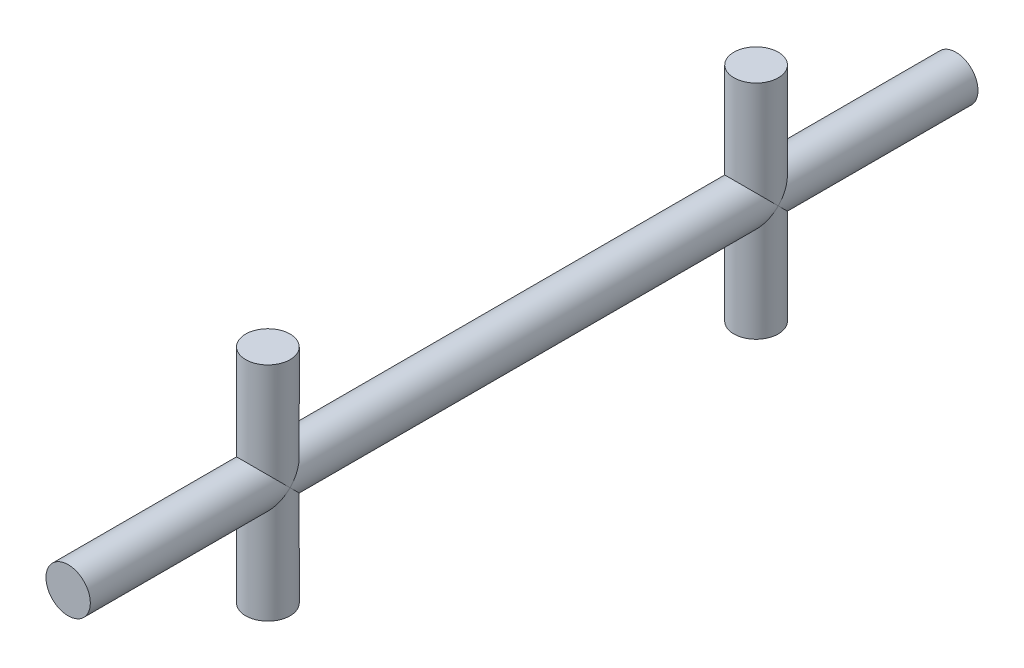
ISO-10303-21;
HEADER;
FILE_DESCRIPTION(('STEP AP214'),'2;1');
FILE_NAME('part.step','',(''),(''),'','','');
FILE_SCHEMA(('AUTOMOTIVE_DESIGN { 1 0 10303 214 1 1 1 1 }'));
ENDSEC;
DATA;
#1=APPLICATION_CONTEXT('core data for automotive mechanical design processes');
#2=APPLICATION_PROTOCOL_DEFINITION('international standard','automotive_design',2000,#1);
#3=PRODUCT_CONTEXT('',#1,'mechanical');
#4=PRODUCT('Part','Part','',(#3));
#5=PRODUCT_RELATED_PRODUCT_CATEGORY('part','',(#4));
#6=PRODUCT_DEFINITION_FORMATION('','',#4);
#7=PRODUCT_DEFINITION_CONTEXT('part definition',#1,'design');
#8=PRODUCT_DEFINITION('design','',#6,#7);
#9=PRODUCT_DEFINITION_SHAPE('','',#8);
#10=(LENGTH_UNIT() NAMED_UNIT(*) SI_UNIT(.MILLI.,.METRE.));
#11=(NAMED_UNIT(*) PLANE_ANGLE_UNIT() SI_UNIT($,.RADIAN.));
#12=(NAMED_UNIT(*) SI_UNIT($,.STERADIAN.) SOLID_ANGLE_UNIT());
#13=UNCERTAINTY_MEASURE_WITH_UNIT(LENGTH_MEASURE(1.E-05),#10,'distance_accuracy_value','');
#14=(GEOMETRIC_REPRESENTATION_CONTEXT(3) GLOBAL_UNCERTAINTY_ASSIGNED_CONTEXT((#13)) GLOBAL_UNIT_ASSIGNED_CONTEXT((#10,
#11,#12)) REPRESENTATION_CONTEXT('',''));
#15=CARTESIAN_POINT('',(0.,0.,0.));
#16=DIRECTION('',(0.,0.,1.));
#17=DIRECTION('',(1.,0.,0.));
#18=AXIS2_PLACEMENT_3D('',#15,#16,#17);
#19=CARTESIAN_POINT('',(0.,0.,-40.));
#20=DIRECTION('',(0.,0.,1.));
#21=DIRECTION('',(1.,0.,0.));
#22=AXIS2_PLACEMENT_3D('',#19,#20,#21);
#23=CYLINDRICAL_SURFACE('',#22,1.);
#24=CARTESIAN_POINT('',(0.,0.,-31.));
#25=DIRECTION('',(0.,0.707106781186547,0.707106781186547));
#26=DIRECTION('',(0.,-0.707106781186547,0.707106781186547));
#27=AXIS2_PLACEMENT_3D('',#24,#25,#26);
#28=ELLIPSE('',#27,1.4142135623731,1.);
#29=CARTESIAN_POINT('',(1.,0.,-31.));
#30=VERTEX_POINT('',#29);
#31=CARTESIAN_POINT('',(-1.,0.,-31.));
#32=VERTEX_POINT('',#31);
#33=EDGE_CURVE('E11',#30,#32,#28,.F.);
#34=ORIENTED_EDGE('',*,*,#33,.F.);
#35=CARTESIAN_POINT('',(0.,0.,-31.));
#36=DIRECTION('',(0.,-0.707106781186547,0.707106781186547));
#37=DIRECTION('',(0.,0.707106781186547,0.707106781186547));
#38=AXIS2_PLACEMENT_3D('',#35,#36,#37);
#39=ELLIPSE('',#38,1.4142135623731,1.);
#40=EDGE_CURVE('E46',#32,#30,#39,.F.);
#41=ORIENTED_EDGE('',*,*,#40,.F.);
#42=EDGE_LOOP('',(#34,#41));
#43=FACE_BOUND('',#42,.T.);
#44=CARTESIAN_POINT('',(0.,0.,-9.));
#45=DIRECTION('',(0.,0.707106781186547,0.707106781186547));
#46=DIRECTION('',(0.,-0.707106781186547,0.707106781186547));
#47=AXIS2_PLACEMENT_3D('',#44,#45,#46);
#48=ELLIPSE('',#47,1.4142135623731,1.);
#49=CARTESIAN_POINT('',(1.,0.,-9.));
#50=VERTEX_POINT('',#49);
#51=CARTESIAN_POINT('',(-1.,0.,-9.));
#52=VERTEX_POINT('',#51);
#53=EDGE_CURVE('E65',#50,#52,#48,.T.);
#54=ORIENTED_EDGE('',*,*,#53,.F.);
#55=CARTESIAN_POINT('',(0.,0.,-9.));
#56=DIRECTION('',(0.,-0.707106781186547,0.707106781186547));
#57=DIRECTION('',(0.,0.707106781186547,0.707106781186547));
#58=AXIS2_PLACEMENT_3D('',#55,#56,#57);
#59=ELLIPSE('',#58,1.4142135623731,1.);
#60=EDGE_CURVE('E62',#52,#50,#59,.T.);
#61=ORIENTED_EDGE('',*,*,#60,.F.);
#62=EDGE_LOOP('',(#54,#61));
#63=FACE_BOUND('',#62,.T.);
#64=ADVANCED_FACE('F32',(#43,#63),#23,.T.);
#65=CARTESIAN_POINT('',(0.,5.,-9.));
#66=DIRECTION('',(0.,1.,0.));
#67=DIRECTION('',(0.,0.,1.));
#68=AXIS2_PLACEMENT_3D('',#65,#66,#67);
#69=PLANE('',#68);
#70=CARTESIAN_POINT('',(0.,5.,-9.));
#71=DIRECTION('',(0.,1.,0.));
#72=DIRECTION('',(0.,0.,1.));
#73=AXIS2_PLACEMENT_3D('',#70,#71,#72);
#74=CIRCLE('',#73,1.);
#75=CARTESIAN_POINT('',(0.,5.,-8.));
#76=VERTEX_POINT('',#75);
#77=EDGE_CURVE('E118',#76,#76,#74,.T.);
#78=ORIENTED_EDGE('',*,*,#77,.T.);
#79=EDGE_LOOP('',(#78));
#80=FACE_BOUND('',#79,.T.);
#81=ADVANCED_FACE('F91',(#80),#69,.T.);
#82=CARTESIAN_POINT('',(0.,-5.,-9.));
#83=DIRECTION('',(0.,1.,0.));
#84=DIRECTION('',(0.,0.,1.));
#85=AXIS2_PLACEMENT_3D('',#82,#83,#84);
#86=CYLINDRICAL_SURFACE('',#85,1.);
#87=ORIENTED_EDGE('',*,*,#77,.F.);
#88=EDGE_LOOP('',(#87));
#89=FACE_BOUND('',#88,.T.);
#90=CARTESIAN_POINT('',(0.,0.,-9.));
#91=DIRECTION('',(0.,-0.707106781186547,0.707106781186547));
#92=DIRECTION('',(0.,0.707106781186547,0.707106781186547));
#93=AXIS2_PLACEMENT_3D('',#90,#91,#92);
#94=ELLIPSE('',#93,1.4142135623731,1.);
#95=EDGE_CURVE('E68',#52,#50,#94,.F.);
#96=ORIENTED_EDGE('',*,*,#95,.T.);
#97=ORIENTED_EDGE('',*,*,#53,.T.);
#98=EDGE_LOOP('',(#96,#97));
#99=FACE_BOUND('',#98,.T.);
#100=ADVANCED_FACE('F78',(#89,#99),#86,.T.);
#101=CARTESIAN_POINT('',(0.,0.,0.));
#102=DIRECTION('',(0.,0.,1.));
#103=DIRECTION('',(1.,0.,0.));
#104=AXIS2_PLACEMENT_3D('',#101,#102,#103);
#105=PLANE('',#104);
#106=CARTESIAN_POINT('',(0.,0.,0.));
#107=DIRECTION('',(0.,0.,1.));
#108=DIRECTION('',(1.,0.,0.));
#109=AXIS2_PLACEMENT_3D('',#106,#107,#108);
#110=CIRCLE('',#109,1.);
#111=CARTESIAN_POINT('',(1.,0.,0.));
#112=VERTEX_POINT('',#111);
#113=EDGE_CURVE('E110',#112,#112,#110,.T.);
#114=ORIENTED_EDGE('',*,*,#113,.T.);
#115=EDGE_LOOP('',(#114));
#116=FACE_BOUND('',#115,.T.);
#117=ADVANCED_FACE('F98',(#116),#105,.T.);
#118=CARTESIAN_POINT('',(0.,0.,-9.));
#119=DIRECTION('',(0.,0.707106781186547,0.707106781186547));
#120=DIRECTION('',(0.,-0.707106781186547,0.707106781186547));
#121=AXIS2_PLACEMENT_3D('',#118,#119,#120);
#122=ELLIPSE('',#121,1.4142135623731,1.);
#123=EDGE_CURVE('E74',#50,#52,#122,.F.);
#124=ORIENTED_EDGE('',*,*,#123,.F.);
#125=ORIENTED_EDGE('',*,*,#95,.F.);
#126=EDGE_LOOP('',(#124,#125));
#127=FACE_BOUND('',#126,.T.);
#128=ORIENTED_EDGE('',*,*,#113,.F.);
#129=EDGE_LOOP('',(#128));
#130=FACE_BOUND('',#129,.T.);
#131=ADVANCED_FACE('F72',(#127,#130),#23,.T.);
#132=ORIENTED_EDGE('',*,*,#60,.T.);
#133=ORIENTED_EDGE('',*,*,#123,.T.);
#134=EDGE_LOOP('',(#132,#133));
#135=FACE_BOUND('',#134,.T.);
#136=CARTESIAN_POINT('',(0.,-5.,-9.));
#137=DIRECTION('',(0.,1.,0.));
#138=DIRECTION('',(0.,0.,1.));
#139=AXIS2_PLACEMENT_3D('',#136,#137,#138);
#140=CIRCLE('',#139,1.);
#141=CARTESIAN_POINT('',(0.,-5.,-8.));
#142=VERTEX_POINT('',#141);
#143=EDGE_CURVE('E113',#142,#142,#140,.T.);
#144=ORIENTED_EDGE('',*,*,#143,.T.);
#145=EDGE_LOOP('',(#144));
#146=FACE_BOUND('',#145,.T.);
#147=ADVANCED_FACE('F80',(#135,#146),#86,.T.);
#148=CARTESIAN_POINT('',(0.,-5.,-9.));
#149=DIRECTION('',(0.,1.,0.));
#150=DIRECTION('',(0.,0.,1.));
#151=AXIS2_PLACEMENT_3D('',#148,#149,#150);
#152=PLANE('',#151);
#153=ORIENTED_EDGE('',*,*,#143,.F.);
#154=EDGE_LOOP('',(#153));
#155=FACE_BOUND('',#154,.T.);
#156=ADVANCED_FACE('F136',(#155),#152,.F.);
#157=CARTESIAN_POINT('',(0.,5.,-31.));
#158=DIRECTION('',(0.,1.,0.));
#159=DIRECTION('',(0.,0.,1.));
#160=AXIS2_PLACEMENT_3D('',#157,#158,#159);
#161=PLANE('',#160);
#162=CARTESIAN_POINT('',(0.,5.,-31.));
#163=DIRECTION('',(0.,1.,0.));
#164=DIRECTION('',(0.,0.,1.));
#165=AXIS2_PLACEMENT_3D('',#162,#163,#164);
#166=CIRCLE('',#165,1.);
#167=CARTESIAN_POINT('',(0.,5.,-30.));
#168=VERTEX_POINT('',#167);
#169=EDGE_CURVE('E124',#168,#168,#166,.T.);
#170=ORIENTED_EDGE('',*,*,#169,.T.);
#171=EDGE_LOOP('',(#170));
#172=FACE_BOUND('',#171,.T.);
#173=ADVANCED_FACE('F128',(#172),#161,.T.);
#174=CARTESIAN_POINT('',(0.,-5.,-31.));
#175=DIRECTION('',(0.,1.,0.));
#176=DIRECTION('',(0.,0.,1.));
#177=AXIS2_PLACEMENT_3D('',#174,#175,#176);
#178=CYLINDRICAL_SURFACE('',#177,1.);
#179=ORIENTED_EDGE('',*,*,#169,.F.);
#180=EDGE_LOOP('',(#179));
#181=FACE_BOUND('',#180,.T.);
#182=ORIENTED_EDGE('',*,*,#40,.T.);
#183=CARTESIAN_POINT('',(0.,0.,-31.));
#184=DIRECTION('',(0.,0.707106781186547,0.707106781186547));
#185=DIRECTION('',(0.,-0.707106781186547,0.707106781186547));
#186=AXIS2_PLACEMENT_3D('',#183,#184,#185);
#187=ELLIPSE('',#186,1.4142135623731,1.);
#188=EDGE_CURVE('E40',#30,#32,#187,.T.);
#189=ORIENTED_EDGE('',*,*,#188,.T.);
#190=EDGE_LOOP('',(#182,#189));
#191=FACE_BOUND('',#190,.T.);
#192=ADVANCED_FACE('F85',(#181,#191),#178,.T.);
#193=CARTESIAN_POINT('',(0.,0.,-31.));
#194=DIRECTION('',(0.,-0.707106781186547,0.707106781186547));
#195=DIRECTION('',(0.,0.707106781186547,0.707106781186547));
#196=AXIS2_PLACEMENT_3D('',#193,#194,#195);
#197=ELLIPSE('',#196,1.4142135623731,1.);
#198=EDGE_CURVE('E53',#32,#30,#197,.T.);
#199=ORIENTED_EDGE('',*,*,#198,.T.);
#200=ORIENTED_EDGE('',*,*,#33,.T.);
#201=EDGE_LOOP('',(#199,#200));
#202=FACE_BOUND('',#201,.T.);
#203=CARTESIAN_POINT('',(0.,-5.,-31.));
#204=DIRECTION('',(0.,1.,0.));
#205=DIRECTION('',(0.,0.,1.));
#206=AXIS2_PLACEMENT_3D('',#203,#204,#205);
#207=CIRCLE('',#206,1.);
#208=CARTESIAN_POINT('',(0.,-5.,-30.));
#209=VERTEX_POINT('',#208);
#210=EDGE_CURVE('E121',#209,#209,#207,.T.);
#211=ORIENTED_EDGE('',*,*,#210,.T.);
#212=EDGE_LOOP('',(#211));
#213=FACE_BOUND('',#212,.T.);
#214=ADVANCED_FACE('F87',(#202,#213),#178,.T.);
#215=CARTESIAN_POINT('',(0.,-5.,-31.));
#216=DIRECTION('',(0.,1.,0.));
#217=DIRECTION('',(0.,0.,1.));
#218=AXIS2_PLACEMENT_3D('',#215,#216,#217);
#219=PLANE('',#218);
#220=ORIENTED_EDGE('',*,*,#210,.F.);
#221=EDGE_LOOP('',(#220));
#222=FACE_BOUND('',#221,.T.);
#223=ADVANCED_FACE('F104',(#222),#219,.F.);
#224=CARTESIAN_POINT('',(0.,0.,-40.));
#225=DIRECTION('',(0.,0.,1.));
#226=DIRECTION('',(1.,0.,0.));
#227=AXIS2_PLACEMENT_3D('',#224,#225,#226);
#228=PLANE('',#227);
#229=CARTESIAN_POINT('',(0.,0.,-40.));
#230=DIRECTION('',(0.,0.,1.));
#231=DIRECTION('',(1.,0.,0.));
#232=AXIS2_PLACEMENT_3D('',#229,#230,#231);
#233=CIRCLE('',#232,1.);
#234=CARTESIAN_POINT('',(1.,0.,-40.));
#235=VERTEX_POINT('',#234);
#236=EDGE_CURVE('E76',#235,#235,#233,.T.);
#237=ORIENTED_EDGE('',*,*,#236,.F.);
#238=EDGE_LOOP('',(#237));
#239=FACE_BOUND('',#238,.T.);
#240=ADVANCED_FACE('F100',(#239),#228,.F.);
#241=ORIENTED_EDGE('',*,*,#188,.F.);
#242=ORIENTED_EDGE('',*,*,#198,.F.);
#243=EDGE_LOOP('',(#241,#242));
#244=FACE_BOUND('',#243,.T.);
#245=ORIENTED_EDGE('',*,*,#236,.T.);
#246=EDGE_LOOP('',(#245));
#247=FACE_BOUND('',#246,.T.);
#248=ADVANCED_FACE('F34',(#244,#247),#23,.T.);
#249=CLOSED_SHELL('',(#64,#81,#100,#117,#131,#147,#156,#173,#192,#214,#223,#240,#248));
#250=MANIFOLD_SOLID_BREP('B2',#249);
#251=ADVANCED_BREP_SHAPE_REPRESENTATION('',(#18,#250),#14);
#252=SHAPE_DEFINITION_REPRESENTATION(#9,#251);
ENDSEC;
END-ISO-10303-21;
